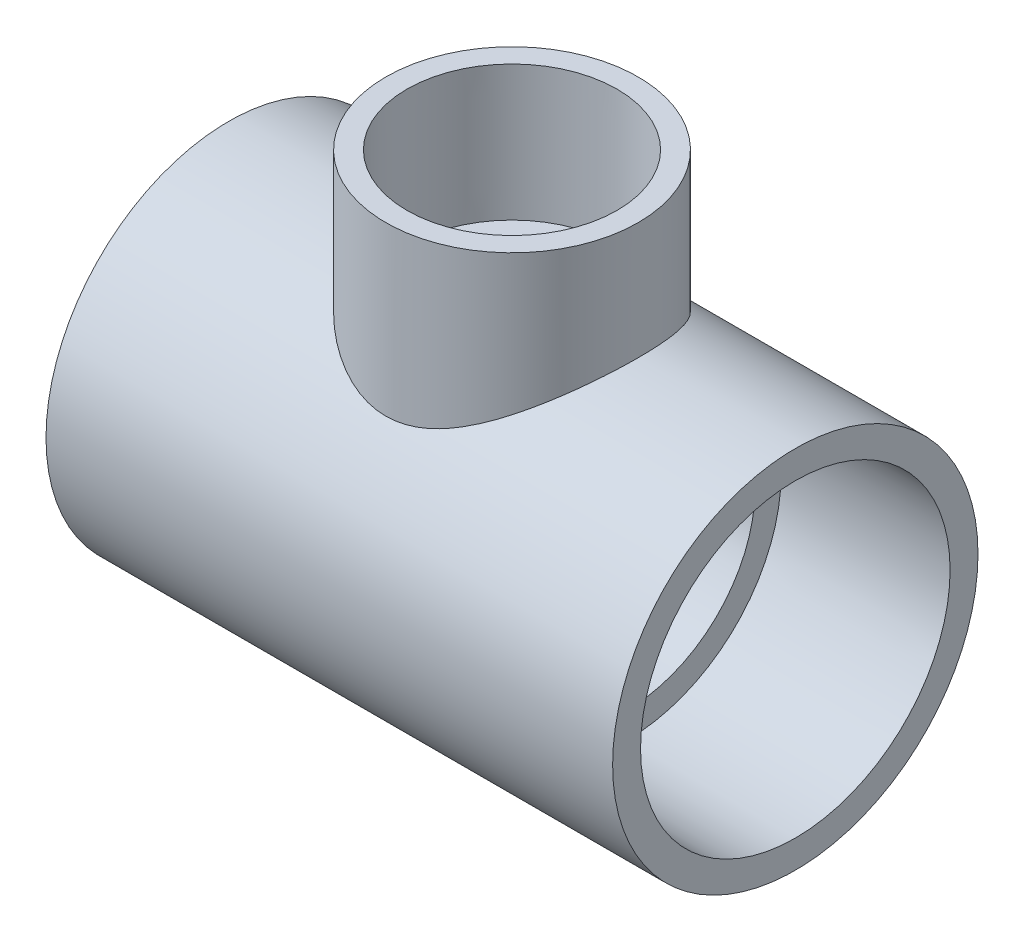
ISO-10303-21;
HEADER;
FILE_DESCRIPTION(('STEP AP214'),'2;1');
FILE_NAME('part.step','',(''),(''),'','','');
FILE_SCHEMA(('AUTOMOTIVE_DESIGN { 1 0 10303 214 1 1 1 1 }'));
ENDSEC;
DATA;
#1=APPLICATION_CONTEXT('core data for automotive mechanical design processes');
#2=APPLICATION_PROTOCOL_DEFINITION('international standard','automotive_design',2000,#1);
#3=PRODUCT_CONTEXT('',#1,'mechanical');
#4=PRODUCT('Part','Part','',(#3));
#5=PRODUCT_RELATED_PRODUCT_CATEGORY('part','',(#4));
#6=PRODUCT_DEFINITION_FORMATION('','',#4);
#7=PRODUCT_DEFINITION_CONTEXT('part definition',#1,'design');
#8=PRODUCT_DEFINITION('design','',#6,#7);
#9=PRODUCT_DEFINITION_SHAPE('','',#8);
#10=(LENGTH_UNIT() NAMED_UNIT(*) SI_UNIT(.MILLI.,.METRE.));
#11=(NAMED_UNIT(*) PLANE_ANGLE_UNIT() SI_UNIT($,.RADIAN.));
#12=(NAMED_UNIT(*) SI_UNIT($,.STERADIAN.) SOLID_ANGLE_UNIT());
#13=UNCERTAINTY_MEASURE_WITH_UNIT(LENGTH_MEASURE(1.E-05),#10,'distance_accuracy_value','');
#14=(GEOMETRIC_REPRESENTATION_CONTEXT(3) GLOBAL_UNCERTAINTY_ASSIGNED_CONTEXT((#13)) GLOBAL_UNIT_ASSIGNED_CONTEXT((#10,
#11,#12)) REPRESENTATION_CONTEXT('',''));
#15=CARTESIAN_POINT('',(0.,0.,0.));
#16=DIRECTION('',(0.,0.,1.));
#17=DIRECTION('',(1.,0.,0.));
#18=AXIS2_PLACEMENT_3D('',#15,#16,#17);
#19=CARTESIAN_POINT('',(-33.2994,0.,0.));
#20=DIRECTION('',(1.,0.,0.));
#21=DIRECTION('',(0.,0.,-1.));
#22=AXIS2_PLACEMENT_3D('',#19,#20,#21);
#23=PLANE('',#22);
#24=CARTESIAN_POINT('',(-33.2994,0.,0.));
#25=DIRECTION('',(-1.,0.,0.));
#26=DIRECTION('',(0.,0.,1.));
#27=AXIS2_PLACEMENT_3D('',#24,#25,#26);
#28=CIRCLE('',#27,44.3484);
#29=CARTESIAN_POINT('',(-33.2994,0.,44.3484));
#30=VERTEX_POINT('',#29);
#31=EDGE_CURVE('E97',#30,#30,#28,.T.);
#32=ORIENTED_EDGE('',*,*,#31,.T.);
#33=EDGE_LOOP('',(#32));
#34=FACE_BOUND('',#33,.T.);
#35=CARTESIAN_POINT('',(-33.2994,0.,0.));
#36=DIRECTION('',(1.,0.,0.));
#37=DIRECTION('',(0.,0.,-1.));
#38=AXIS2_PLACEMENT_3D('',#35,#36,#37);
#39=CIRCLE('',#38,36.83);
#40=CARTESIAN_POINT('',(-33.2994,0.,-36.83));
#41=VERTEX_POINT('',#40);
#42=EDGE_CURVE('E100',#41,#41,#39,.T.);
#43=ORIENTED_EDGE('',*,*,#42,.T.);
#44=EDGE_LOOP('',(#43));
#45=FACE_BOUND('',#44,.T.);
#46=ADVANCED_FACE('F30',(#34,#45),#23,.F.);
#47=CARTESIAN_POINT('',(33.2994,0.,0.));
#48=DIRECTION('',(1.,0.,0.));
#49=DIRECTION('',(0.,0.,-1.));
#50=AXIS2_PLACEMENT_3D('',#47,#48,#49);
#51=PLANE('',#50);
#52=CARTESIAN_POINT('',(33.2994,0.,0.));
#53=DIRECTION('',(1.,0.,0.));
#54=DIRECTION('',(0.,0.,-1.));
#55=AXIS2_PLACEMENT_3D('',#52,#53,#54);
#56=CIRCLE('',#55,36.83);
#57=CARTESIAN_POINT('',(33.2994,0.,-36.83));
#58=VERTEX_POINT('',#57);
#59=EDGE_CURVE('E103',#58,#58,#56,.T.);
#60=ORIENTED_EDGE('',*,*,#59,.F.);
#61=EDGE_LOOP('',(#60));
#62=FACE_BOUND('',#61,.T.);
#63=CARTESIAN_POINT('',(33.2994,0.,0.));
#64=DIRECTION('',(1.,0.,0.));
#65=DIRECTION('',(0.,0.,-1.));
#66=AXIS2_PLACEMENT_3D('',#63,#64,#65);
#67=CIRCLE('',#66,44.3484);
#68=CARTESIAN_POINT('',(33.2994,0.,-44.3484));
#69=VERTEX_POINT('',#68);
#70=EDGE_CURVE('E10',#69,#69,#67,.F.);
#71=ORIENTED_EDGE('',*,*,#70,.F.);
#72=EDGE_LOOP('',(#71));
#73=FACE_BOUND('',#72,.T.);
#74=ADVANCED_FACE('F72',(#62,#73),#51,.T.);
#75=CARTESIAN_POINT('',(33.2994,0.,0.));
#76=DIRECTION('',(-1.,0.,0.));
#77=DIRECTION('',(0.,0.,1.));
#78=AXIS2_PLACEMENT_3D('',#75,#76,#77);
#79=CYLINDRICAL_SURFACE('',#78,52.705);
#80=CARTESIAN_POINT('',(-81.7372,0.,0.));
#81=DIRECTION('',(-1.,0.,0.));
#82=DIRECTION('',(0.,0.,1.));
#83=AXIS2_PLACEMENT_3D('',#80,#81,#82);
#84=CIRCLE('',#83,52.705);
#85=CARTESIAN_POINT('',(-81.7372,0.,52.705));
#86=VERTEX_POINT('',#85);
#87=EDGE_CURVE('E114',#86,#86,#84,.T.);
#88=ORIENTED_EDGE('',*,*,#87,.F.);
#89=EDGE_LOOP('',(#88));
#90=FACE_BOUND('',#89,.T.);
#91=CARTESIAN_POINT('',(81.7372,0.,0.));
#92=DIRECTION('',(-1.,0.,0.));
#93=DIRECTION('',(0.,0.,1.));
#94=AXIS2_PLACEMENT_3D('',#91,#92,#93);
#95=CIRCLE('',#94,52.705);
#96=CARTESIAN_POINT('',(81.7372,0.,52.705));
#97=VERTEX_POINT('',#96);
#98=EDGE_CURVE('E102',#97,#97,#95,.T.);
#99=ORIENTED_EDGE('',*,*,#98,.T.);
#100=EDGE_LOOP('',(#99));
#101=FACE_BOUND('',#100,.T.);
#102=CARTESIAN_POINT('',(33.2994,50.6054683463161,-14.7276474173576));
#103=CARTESIAN_POINT('',(32.8665611440652,50.3206502251527,-15.7062959214014));
#104=CARTESIAN_POINT('',(32.3930904135624,50.0122199897805,-16.6601238236715));
#105=CARTESIAN_POINT('',(31.3710163571658,49.3563608444083,-18.5130654533819));
#106=CARTESIAN_POINT('',(30.822367998837,49.0089085823483,-19.4121459165471));
#107=CARTESIAN_POINT('',(29.6542641212973,48.2828000839408,-21.1537453269061));
#108=CARTESIAN_POINT('',(29.0346080672534,47.9040563609287,-21.9960928596377));
#109=CARTESIAN_POINT('',(27.7309250428089,47.125303807805,-23.6184750539674));
#110=CARTESIAN_POINT('',(27.0469080016118,46.7252982619615,-24.3985192931031));
#111=CARTESIAN_POINT('',(25.6224134085627,45.9154646524918,-25.8902186948125));
#112=CARTESIAN_POINT('',(24.8822656767589,45.5057024008569,-26.6022250876623));
#113=CARTESIAN_POINT('',(23.3452436936839,44.6837992323151,-27.9607833996699));
#114=CARTESIAN_POINT('',(22.548364001516,44.2716580907526,-28.6073290263504));
#115=CARTESIAN_POINT('',(20.9009364720651,43.4557336191509,-29.832151157849));
#116=CARTESIAN_POINT('',(20.0504348440655,43.0519434805709,-30.4104852433529));
#117=CARTESIAN_POINT('',(18.2970327764897,42.2638335931482,-31.4965925625555));
#118=CARTESIAN_POINT('',(17.3941434405788,41.8795097504999,-32.0043806717088));
#119=CARTESIAN_POINT('',(15.7160838272372,41.2138942464681,-32.8552165917502));
#120=CARTESIAN_POINT('',(14.9496732904478,40.9269876499965,-33.21117575846));
#121=CARTESIAN_POINT('',(13.3851747955389,40.3817890030868,-33.871988591524));
#122=CARTESIAN_POINT('',(12.5870886395015,40.1234953279695,-34.1768451600559));
#123=CARTESIAN_POINT('',(10.9626943903986,39.6439530669855,-34.731951641189));
#124=CARTESIAN_POINT('',(10.1364318311576,39.4226478324421,-34.9822852386291));
#125=CARTESIAN_POINT('',(8.45805652514074,39.0248412404425,-35.425523690364));
#126=CARTESIAN_POINT('',(7.60594842254273,38.8483318863998,-35.6184387955925));
#127=CARTESIAN_POINT('',(6.00983093750421,38.5701865441199,-35.9192590160114));
#128=CARTESIAN_POINT('',(5.26866149354494,38.4613086919072,-36.0355531696703));
#129=CARTESIAN_POINT('',(3.77565851961246,38.285373772421,-36.22242099782));
#130=CARTESIAN_POINT('',(3.02382616915657,38.2183121158308,-36.2929996896039));
#131=CARTESIAN_POINT('',(1.51501165500658,38.1286236004495,-36.3872143075746));
#132=CARTESIAN_POINT('',(0.758032839840528,38.1059701930336,-36.4108782809269));
#133=CARTESIAN_POINT('',(-0.755948742673274,38.1059288087277,-36.410921689249));
#134=CARTESIAN_POINT('',(-1.51295151013983,38.1285419853253,-36.387299919279));
#135=CARTESIAN_POINT('',(-3.02016063396608,38.2180535473463,-36.2932714239998));
#136=CARTESIAN_POINT('',(-3.77037587925651,38.2848814983369,-36.2229391082268));
#137=CARTESIAN_POINT('',(-5.2601415011837,38.4601756002979,-36.0367613553237));
#138=CARTESIAN_POINT('',(-5.99969194991259,38.5686414696664,-35.9209162260017));
#139=CARTESIAN_POINT('',(-7.46473392516924,38.8235048233906,-35.6453034027117));
#140=CARTESIAN_POINT('',(-8.19020868103966,38.9699448875812,-35.4854863914474));
#141=CARTESIAN_POINT('',(-9.6230195466557,39.2960416236094,-35.1240275242703));
#142=CARTESIAN_POINT('',(-10.3303531533905,39.4757028513339,-34.9223799313285));
#143=CARTESIAN_POINT('',(-11.9799198902796,39.9342568934599,-34.3981650588975));
#144=CARTESIAN_POINT('',(-12.9133066207616,40.2253939983238,-34.0583595063446));
#145=CARTESIAN_POINT('',(-14.7380138905766,40.8477154162274,-33.3094297534369));
#146=CARTESIAN_POINT('',(-15.6293191463432,41.178914126027,-32.9002806120711));
#147=CARTESIAN_POINT('',(-17.3689838676186,41.8701168408864,-32.0160236286731));
#148=CARTESIAN_POINT('',(-18.2172648917961,42.2301705748192,-31.5408008325445));
#149=CARTESIAN_POINT('',(-19.8675565923446,42.9678761888124,-30.5282005108595));
#150=CARTESIAN_POINT('',(-20.6695720826729,43.3455262305475,-29.9908294694133));
#151=CARTESIAN_POINT('',(-22.2434900465209,44.1175186246307,-28.8435492699077));
#152=CARTESIAN_POINT('',(-23.0143112341843,44.5120453785776,-28.2322817130732));
#153=CARTESIAN_POINT('',(-24.5043332102096,45.3003987182131,-26.9491733728839));
#154=CARTESIAN_POINT('',(-25.2235284457894,45.694225224155,-26.2773260911787));
#155=CARTESIAN_POINT('',(-26.6061644865444,46.4717696567967,-24.8763393680838));
#156=CARTESIAN_POINT('',(-27.2697192241618,46.8555070779107,-24.147323225635));
#157=CARTESIAN_POINT('',(-28.5393006590755,47.6055973250572,-22.6326709518308));
#158=CARTESIAN_POINT('',(-29.1453458220272,47.971955712271,-21.8470531381234));
#159=CARTESIAN_POINT('',(-30.0659510172286,48.5381376917172,-20.5462838819497));
#160=CARTESIAN_POINT('',(-30.4002348214987,48.7460213205137,-20.0484651418164));
#161=CARTESIAN_POINT('',(-31.0455920646813,49.1510837771071,-19.0338187414247));
#162=CARTESIAN_POINT('',(-31.3566680671288,49.3482637865689,-18.5169931901031));
#163=CARTESIAN_POINT('',(-31.9546738951111,49.7303896450844,-17.4647873989957));
#164=CARTESIAN_POINT('',(-32.2415920043957,49.9153295486564,-16.9293983318419));
#165=CARTESIAN_POINT('',(-32.7899107007319,50.2712458436698,-15.8412930118723));
#166=CARTESIAN_POINT('',(-33.0513142880007,50.4422238764809,-15.2885788064177));
#167=CARTESIAN_POINT('',(-33.6424061957271,50.8311720521861,-13.952097143725));
#168=CARTESIAN_POINT('',(-33.95995374164,51.0420921632532,-13.1608387788513));
#169=CARTESIAN_POINT('',(-34.5408619208921,51.4304177659738,-11.5505514861348));
#170=CARTESIAN_POINT('',(-34.8042158784084,51.6078191284093,-10.7315191514201));
#171=CARTESIAN_POINT('',(-35.2737264903061,51.9256129183516,-9.06990879162915));
#172=CARTESIAN_POINT('',(-35.4798694863415,52.0659965079659,-8.22732519676341));
#173=CARTESIAN_POINT('',(-35.832195181296,52.3067207696972,-6.52408111197113));
#174=CARTESIAN_POINT('',(-35.9783804414547,52.4070631522661,-5.66342139586118));
#175=CARTESIAN_POINT('',(-36.2091175780468,52.5657353000021,-3.92718298064145));
#176=CARTESIAN_POINT('',(-36.2934708025879,52.6239296462847,-3.05156536475282));
#177=CARTESIAN_POINT('',(-36.3985141631615,52.6964303180674,-1.29468324512423));
#178=CARTESIAN_POINT('',(-36.4192035409758,52.7107361208676,-0.413418674255921));
#179=CARTESIAN_POINT('',(-36.3966022283054,52.6951228936678,1.34775556525929));
#180=CARTESIAN_POINT('',(-36.3533213658443,52.6652106570756,2.22766542124741));
#181=CARTESIAN_POINT('',(-36.2034568064999,52.5618752263174,3.97946728956689));
#182=CARTESIAN_POINT('',(-36.0968743828008,52.4884529072695,4.85135946279972));
#183=CARTESIAN_POINT('',(-35.8273704700079,52.3034863033774,6.54682993662916));
#184=CARTESIAN_POINT('',(-35.6668185241748,52.1935473737847,7.37096319994951));
#185=CARTESIAN_POINT('',(-35.29078158674,51.9373056826485,9.00076675563747));
#186=CARTESIAN_POINT('',(-35.0752982644282,51.7910040261224,9.80643760824198));
#187=CARTESIAN_POINT('',(-34.5918634344535,51.4648285644133,11.3950042351841));
#188=CARTESIAN_POINT('',(-34.3239033591973,51.2849492774185,12.1778962665431));
#189=CARTESIAN_POINT('',(-33.7383125571079,50.8948862098211,13.717070808442));
#190=CARTESIAN_POINT('',(-33.4206792941219,50.6847008819325,14.4733519578997));
#191=CARTESIAN_POINT('',(-32.7134685912182,50.2210903070328,16.0109498755409));
#192=CARTESIAN_POINT('',(-32.3203139383632,49.9656198358427,16.7900031527964));
#193=CARTESIAN_POINT('',(-31.4835429520878,49.4284730412317,18.3110281875485));
#194=CARTESIAN_POINT('',(-31.0399246069283,49.1467956731523,19.05299846503));
#195=CARTESIAN_POINT('',(-30.1052347741445,48.5618736477131,20.4980323651676));
#196=CARTESIAN_POINT('',(-29.6141391418831,48.2586180376238,21.20107590272));
#197=CARTESIAN_POINT('',(-28.5875763235232,47.6355591989406,22.5662049373814));
#198=CARTESIAN_POINT('',(-28.0521067538933,47.3157550817961,23.2282882309842));
#199=CARTESIAN_POINT('',(-26.8451055332056,46.6094894703358,24.6186685140071));
#200=CARTESIAN_POINT('',(-26.1658799833141,46.2209032995252,25.3392211726244));
#201=CARTESIAN_POINT('',(-24.7533191797111,45.4361661940416,26.7208375279026));
#202=CARTESIAN_POINT('',(-24.0199759815214,45.0400141550503,27.3818924585465));
#203=CARTESIAN_POINT('',(-22.5011790462176,44.2486828315093,28.6430724286313));
#204=CARTESIAN_POINT('',(-21.7156907214494,43.85350437662,29.2431563449235));
#205=CARTESIAN_POINT('',(-20.0949583242449,43.0739591687632,30.379693147953));
#206=CARTESIAN_POINT('',(-19.259720655873,42.6895910335574,30.9161541981678));
#207=CARTESIAN_POINT('',(-17.6363811139841,41.9837132239077,31.8668407042577));
#208=CARTESIAN_POINT('',(-16.8533288969269,41.6599605607831,32.2880243622812));
#209=CARTESIAN_POINT('',(-15.2502524567415,41.037642068012,33.0753799210958));
#210=CARTESIAN_POINT('',(-14.4302279178686,40.7390764535261,33.4415513519655));
#211=CARTESIAN_POINT('',(-12.7563998331406,40.1767209604795,34.1151050854999));
#212=CARTESIAN_POINT('',(-11.9026525748974,39.9128760732178,34.4225807379996));
#213=CARTESIAN_POINT('',(-10.1632124086143,39.4291426928053,34.9756336342444));
#214=CARTESIAN_POINT('',(-9.2775273334437,39.2092435071994,35.2212259386671));
#215=CARTESIAN_POINT('',(-7.64770239071675,38.8592513906805,35.6066012870361));
#216=CARTESIAN_POINT('',(-6.90815967021484,38.7200506367341,35.7575894274376));
#217=CARTESIAN_POINT('',(-5.4148302752731,38.4816956253047,36.0139820623098));
#218=CARTESIAN_POINT('',(-4.66104537736711,38.3825364072131,36.1193922033972));
#219=CARTESIAN_POINT('',(-3.1446007043365,38.2280480749643,36.2828622168616));
#220=CARTESIAN_POINT('',(-2.38195024079909,38.1726765654167,36.3409678911762));
#221=CARTESIAN_POINT('',(-0.852517068051437,38.1078276534348,36.4089652803883));
#222=CARTESIAN_POINT('',(-0.0857343015880634,38.0983508885181,36.4188563255432));
#223=CARTESIAN_POINT('',(1.44647036672971,38.1256948399528,36.3902293215398));
#224=CARTESIAN_POINT('',(2.21189139954134,38.1625386402308,36.3516871356091));
#225=CARTESIAN_POINT('',(3.7352741108432,38.2810505131101,36.2268618829026));
#226=CARTESIAN_POINT('',(4.49323583527374,38.3627183094739,36.1405791103385));
#227=CARTESIAN_POINT('',(5.99759552435104,38.5678418477658,35.9215955283517));
#228=CARTESIAN_POINT('',(6.74397811376741,38.6913488810612,35.7888377377823));
#229=CARTESIAN_POINT('',(8.22017866661303,38.9757582674928,35.4788868446909));
#230=CARTESIAN_POINT('',(8.94999440598541,39.1366656093148,35.3016878140707));
#231=CARTESIAN_POINT('',(10.6026044846279,39.5431621217943,34.846433733906));
#232=CARTESIAN_POINT('',(11.518770113632,39.7997275161389,34.5540476123375));
#233=CARTESIAN_POINT('',(13.313740491016,40.3557908661739,33.902953291411));
#234=CARTESIAN_POINT('',(14.1925335952564,40.6553020772324,33.5442246052583));
#235=CARTESIAN_POINT('',(15.9109879774542,41.2866014567791,32.7640896954131));
#236=CARTESIAN_POINT('',(16.7506026206021,41.6184267090696,32.3426111592765));
#237=CARTESIAN_POINT('',(18.387915959168,42.3039721654088,31.4406081641494));
#238=CARTESIAN_POINT('',(19.1856172478921,42.6576910118782,30.9600873644388));
#239=CARTESIAN_POINT('',(20.7551427780747,43.3860049998939,29.9312147062024));
#240=CARTESIAN_POINT('',(21.5260001407215,43.7608892066854,29.381594372507));
#241=CARTESIAN_POINT('',(23.0211999075391,44.5154189224703,28.2253628731629));
#242=CARTESIAN_POINT('',(23.7455423472477,44.8950644278256,27.6187517510565));
#243=CARTESIAN_POINT('',(25.1460904837655,45.6513065963607,26.349968767592));
#244=CARTESIAN_POINT('',(25.8222792827948,46.0279021485836,25.687777578278));
#245=CARTESIAN_POINT('',(27.1237995177498,46.7704857961448,24.3094952961893));
#246=CARTESIAN_POINT('',(27.749126383615,47.1364729363956,23.5933993710576));
#247=CARTESIAN_POINT('',(29.0423175559362,47.9083354710608,21.9891644640086));
#248=CARTESIAN_POINT('',(29.7007682478271,48.3111200768233,21.0919080786322));
#249=CARTESIAN_POINT('',(30.9388680861248,49.0819958991459,19.2299105842522));
#250=CARTESIAN_POINT('',(31.5185036014474,49.4500811110785,18.2651578453418));
#251=CARTESIAN_POINT('',(32.3227717839963,49.9678212887829,16.7723375089251));
#252=CARTESIAN_POINT('',(32.5798715062268,50.1345864760821,16.2674104046566));
#253=CARTESIAN_POINT('',(33.0716110882109,50.4555259188384,15.2428639265858));
#254=CARTESIAN_POINT('',(33.306254193056,50.60970199301,14.7232466896799));
#255=CARTESIAN_POINT('',(33.7520591282481,50.9041932641099,13.6703647360248));
#256=CARTESIAN_POINT('',(33.9632274701851,51.0445123035853,13.1371038545849));
#257=CARTESIAN_POINT('',(34.3611670163045,51.3101477110023,12.0579685462653));
#258=CARTESIAN_POINT('',(34.5479404330373,51.435465439434,11.5120952685865));
#259=CARTESIAN_POINT('',(34.9771522568925,51.724548070549,10.1523486276514));
#260=CARTESIAN_POINT('',(35.2051036302705,51.8791032326492,9.33185859986233));
#261=CARTESIAN_POINT('',(35.6038768900193,52.1505332517521,7.67116562842779));
#262=CARTESIAN_POINT('',(35.7747088312924,52.267414740432,6.83096618218611));
#263=CARTESIAN_POINT('',(36.0570155104442,52.4610444611188,5.13640335433802));
#264=CARTESIAN_POINT('',(36.1685153133743,52.5378096401426,4.28204611127758));
#265=CARTESIAN_POINT('',(36.3306906124574,52.6495869653268,2.56482874986071));
#266=CARTESIAN_POINT('',(36.3813648510638,52.6845982482404,1.70196845607859));
#267=CARTESIAN_POINT('',(36.4211780435257,52.7120990276286,-0.0273623829781833));
#268=CARTESIAN_POINT('',(36.4102095635025,52.7045142857299,-0.89383659974274));
#269=CARTESIAN_POINT('',(36.3266482169876,52.6468218450479,-2.6224221319165));
#270=CARTESIAN_POINT('',(36.2540516466636,52.5967115904923,-3.48453318196776));
#271=CARTESIAN_POINT('',(36.0483444674899,52.4551328892648,-5.19752139302493));
#272=CARTESIAN_POINT('',(35.9152698830672,52.3636890635865,-6.04840493178543));
#273=CARTESIAN_POINT('',(35.5905104505232,52.141479066308,-7.73339226910032));
#274=CARTESIAN_POINT('',(35.398840110652,52.0107226286035,-8.56750016686188));
#275=CARTESIAN_POINT('',(34.9332820875543,51.6949212592809,-10.3115164035959));
#276=CARTESIAN_POINT('',(34.6523501099111,51.5052836750323,-11.2187174070705));
#277=CARTESIAN_POINT('',(34.024388173766,51.0849104284347,-12.9994611769086));
#278=CARTESIAN_POINT('',(33.677387195239,50.8541927879776,-13.8730184992363));
#279=CARTESIAN_POINT('',(33.2994,50.6054683463161,-14.7276474173576));
#280=B_SPLINE_CURVE_WITH_KNOTS('',3,(#102,#103,#104,#105,#106,#107,#108,#109,#110,#111,#112,
#113,#114,#115,#116,#117,#118,#119,#120,#121,#122,#123,#124,#125,#126,#127,#128,#129,#130,#131,
#132,#133,#134,#135,#136,#137,#138,#139,#140,#141,#142,#143,#144,#145,#146,#147,#148,#149,#150,
#151,#152,#153,#154,#155,#156,#157,#158,#159,#160,#161,#162,#163,#164,#165,#166,#167,#168,#169,
#170,#171,#172,#173,#174,#175,#176,#177,#178,#179,#180,#181,#182,#183,#184,#185,#186,#187,#188,
#189,#190,#191,#192,#193,#194,#195,#196,#197,#198,#199,#200,#201,#202,#203,#204,#205,#206,#207,
#208,#209,#210,#211,#212,#213,#214,#215,#216,#217,#218,#219,#220,#221,#222,#223,#224,#225,#226,
#227,#228,#229,#230,#231,#232,#233,#234,#235,#236,#237,#238,#239,#240,#241,#242,#243,#244,#245,
#246,#247,#248,#249,#250,#251,#252,#253,#254,#255,#256,#257,#258,#259,#260,#261,#262,#263,#264,
#265,#266,#267,#268,#269,#270,#271,#272,#273,#274,#275,#276,#277,#278,#279),.UNSPECIFIED.,.T.,
.F.,(4,2,2,2,2,2,2,2,2,2,2,2,2,2,2,2,2,2,2,2,2,2,2,2,2,2,2,2,2,2,2,2,2,2,2,2,2,2,2,2,2,2,2,2,2,
2,2,2,2,2,2,2,2,2,2,2,2,2,2,2,2,2,2,2,2,2,2,2,2,2,2,2,2,2,2,2,2,2,2,2,2,2,2,2,2,2,2,2,4),(0.,
3.32096507607777,6.64392822402962,9.9765185406003,13.3085955666868,16.622419315588,
19.9365613070575,23.2478853373451,26.5585100725334,29.2335298213485,31.9083976010861,
34.5791304543606,37.2493862148288,39.5212435459262,41.7928514973615,44.0631009966516,
46.3334083473956,48.6001077631511,50.8667918492338,53.1360286039808,55.4055767886368,
58.5063252251836,61.6081912929954,64.7155230953757,67.8225309926169,70.9993396439629,
74.176489475972,77.3469661010442,80.5164212537291,82.4196860093334,84.322740217974,
86.2267121286457,88.1304598835061,90.7626037089452,93.3950715804816,96.0281673786763,
98.6611506860978,101.302556515603,103.943993803368,106.585025317922,109.22600371522,
111.763567085078,114.301053351016,116.838954244395,119.376984757134,122.102089588433,
124.827303094349,127.553909875494,130.280663210465,133.468664742063,136.657135207278,
139.84774212174,143.03793920411,145.874237510441,148.71056004342,151.542333402311,
154.373416919613,156.673679592521,158.973657206271,161.271405239045,163.569185189425,
165.868110696104,168.167022035316,170.468761906099,172.770808973626,175.752397409466,
178.734908111359,181.720882827682,184.706672574617,187.758711252709,190.810747598989,
193.863849722803,196.917225872452,200.463214065692,204.009814759621,205.781136659013,
207.552202205997,209.322775250379,211.093187597138,213.686634242263,216.279624114669,
218.871517698816,221.463464868505,224.059930807046,226.656552803573,229.251630115392,
231.846065408371,234.74744970326,237.647564277961),.UNSPECIFIED.);
#281=CARTESIAN_POINT('',(33.2994,50.6054683463161,-14.7276474173576));
#282=VERTEX_POINT('',#281);
#283=EDGE_CURVE('E55',#282,#282,#280,.T.);
#284=ORIENTED_EDGE('',*,*,#283,.F.);
#285=EDGE_LOOP('',(#284));
#286=FACE_BOUND('',#285,.T.);
#287=ADVANCED_FACE('F67',(#90,#101,#286),#79,.T.);
#288=CARTESIAN_POINT('',(-33.2994,0.,0.));
#289=DIRECTION('',(-1.,0.,0.));
#290=DIRECTION('',(0.,0.,1.));
#291=AXIS2_PLACEMENT_3D('',#288,#289,#290);
#292=CONICAL_SURFACE('',#291,44.3484,0.00629252313381877);
#293=CARTESIAN_POINT('',(-81.7372,0.,0.));
#294=DIRECTION('',(-1.,0.,0.));
#295=DIRECTION('',(0.,0.,1.));
#296=AXIS2_PLACEMENT_3D('',#293,#294,#295);
#297=CIRCLE('',#296,44.6532);
#298=CARTESIAN_POINT('',(-81.7372,0.,44.6532));
#299=VERTEX_POINT('',#298);
#300=EDGE_CURVE('E62',#299,#299,#297,.T.);
#301=ORIENTED_EDGE('',*,*,#300,.T.);
#302=EDGE_LOOP('',(#301));
#303=FACE_BOUND('',#302,.T.);
#304=ORIENTED_EDGE('',*,*,#31,.F.);
#305=EDGE_LOOP('',(#304));
#306=FACE_BOUND('',#305,.T.);
#307=ADVANCED_FACE('F71',(#303,#306),#292,.F.);
#308=CARTESIAN_POINT('',(81.7372,0.,0.));
#309=DIRECTION('',(1.,0.,0.));
#310=DIRECTION('',(0.,0.,-1.));
#311=AXIS2_PLACEMENT_3D('',#308,#309,#310);
#312=CONICAL_SURFACE('',#311,44.6532,0.00629252313381848);
#313=CARTESIAN_POINT('',(81.7372,0.,0.));
#314=DIRECTION('',(-1.,0.,0.));
#315=DIRECTION('',(0.,0.,1.));
#316=AXIS2_PLACEMENT_3D('',#313,#314,#315);
#317=CIRCLE('',#316,44.6532);
#318=CARTESIAN_POINT('',(81.7372,0.,44.6532));
#319=VERTEX_POINT('',#318);
#320=EDGE_CURVE('E106',#319,#319,#317,.T.);
#321=ORIENTED_EDGE('',*,*,#320,.F.);
#322=EDGE_LOOP('',(#321));
#323=FACE_BOUND('',#322,.T.);
#324=ORIENTED_EDGE('',*,*,#70,.T.);
#325=EDGE_LOOP('',(#324));
#326=FACE_BOUND('',#325,.T.);
#327=ADVANCED_FACE('F84',(#323,#326),#312,.F.);
#328=CARTESIAN_POINT('',(0.,0.,0.));
#329=DIRECTION('',(0.,-1.,0.));
#330=DIRECTION('',(1.,0.,0.));
#331=AXIS2_PLACEMENT_3D('',#328,#329,#330);
#332=CYLINDRICAL_SURFACE('',#331,36.4109);
#333=ORIENTED_EDGE('',*,*,#283,.T.);
#334=EDGE_LOOP('',(#333));
#335=FACE_BOUND('',#334,.T.);
#336=CARTESIAN_POINT('',(0.,86.4616,0.));
#337=DIRECTION('',(0.,-1.,0.));
#338=DIRECTION('',(1.,0.,0.));
#339=AXIS2_PLACEMENT_3D('',#336,#337,#338);
#340=CIRCLE('',#339,36.4109);
#341=CARTESIAN_POINT('',(36.4109,86.4616,0.));
#342=VERTEX_POINT('',#341);
#343=EDGE_CURVE('E43',#342,#342,#340,.T.);
#344=ORIENTED_EDGE('',*,*,#343,.T.);
#345=EDGE_LOOP('',(#344));
#346=FACE_BOUND('',#345,.T.);
#347=ADVANCED_FACE('F64',(#335,#346),#332,.T.);
#348=CARTESIAN_POINT('',(0.,86.4616,0.));
#349=DIRECTION('',(0.,1.,0.));
#350=DIRECTION('',(-1.,0.,0.));
#351=AXIS2_PLACEMENT_3D('',#348,#349,#350);
#352=CONICAL_SURFACE('',#351,30.3149,0.00588613215180149);
#353=CARTESIAN_POINT('',(0.,86.4616,0.));
#354=DIRECTION('',(0.,-1.,0.));
#355=DIRECTION('',(1.,0.,0.));
#356=AXIS2_PLACEMENT_3D('',#353,#354,#355);
#357=CIRCLE('',#356,30.3149);
#358=CARTESIAN_POINT('',(30.3149,86.4616,0.));
#359=VERTEX_POINT('',#358);
#360=EDGE_CURVE('E52',#359,#359,#357,.T.);
#361=ORIENTED_EDGE('',*,*,#360,.F.);
#362=EDGE_LOOP('',(#361));
#363=FACE_BOUND('',#362,.T.);
#364=CARTESIAN_POINT('',(0.,47.625,0.));
#365=DIRECTION('',(0.,-1.,0.));
#366=DIRECTION('',(1.,0.,0.));
#367=AXIS2_PLACEMENT_3D('',#364,#365,#366);
#368=CIRCLE('',#367,30.0863);
#369=CARTESIAN_POINT('',(30.0863,47.625,0.));
#370=VERTEX_POINT('',#369);
#371=EDGE_CURVE('E47',#370,#370,#368,.T.);
#372=ORIENTED_EDGE('',*,*,#371,.T.);
#373=EDGE_LOOP('',(#372));
#374=FACE_BOUND('',#373,.T.);
#375=ADVANCED_FACE('F75',(#363,#374),#352,.F.);
#376=CARTESIAN_POINT('',(36.4109,86.4616,0.));
#377=DIRECTION('',(0.,1.,0.));
#378=DIRECTION('',(-1.,0.,0.));
#379=AXIS2_PLACEMENT_3D('',#376,#377,#378);
#380=PLANE('',#379);
#381=ORIENTED_EDGE('',*,*,#360,.T.);
#382=EDGE_LOOP('',(#381));
#383=FACE_BOUND('',#382,.T.);
#384=ORIENTED_EDGE('',*,*,#343,.F.);
#385=EDGE_LOOP('',(#384));
#386=FACE_BOUND('',#385,.T.);
#387=ADVANCED_FACE('F32',(#383,#386),#380,.T.);
#388=CARTESIAN_POINT('',(-81.7372,-52.705,0.));
#389=DIRECTION('',(-1.,0.,0.));
#390=DIRECTION('',(0.,0.,1.));
#391=AXIS2_PLACEMENT_3D('',#388,#389,#390);
#392=PLANE('',#391);
#393=ORIENTED_EDGE('',*,*,#87,.T.);
#394=EDGE_LOOP('',(#393));
#395=FACE_BOUND('',#394,.T.);
#396=ORIENTED_EDGE('',*,*,#300,.F.);
#397=EDGE_LOOP('',(#396));
#398=FACE_BOUND('',#397,.T.);
#399=ADVANCED_FACE('F82',(#395,#398),#392,.T.);
#400=CARTESIAN_POINT('',(81.7372,-52.705,0.));
#401=DIRECTION('',(1.,0.,0.));
#402=DIRECTION('',(0.,0.,-1.));
#403=AXIS2_PLACEMENT_3D('',#400,#401,#402);
#404=PLANE('',#403);
#405=ORIENTED_EDGE('',*,*,#320,.T.);
#406=EDGE_LOOP('',(#405));
#407=FACE_BOUND('',#406,.T.);
#408=ORIENTED_EDGE('',*,*,#98,.F.);
#409=EDGE_LOOP('',(#408));
#410=FACE_BOUND('',#409,.T.);
#411=ADVANCED_FACE('F122',(#407,#410),#404,.T.);
#412=CARTESIAN_POINT('',(0.,47.625,0.));
#413=DIRECTION('',(0.,-1.,0.));
#414=DIRECTION('',(1.,0.,0.));
#415=AXIS2_PLACEMENT_3D('',#412,#413,#414);
#416=PLANE('',#415);
#417=CARTESIAN_POINT('',(0.,47.625,0.));
#418=DIRECTION('',(0.,-1.,0.));
#419=DIRECTION('',(1.,0.,0.));
#420=AXIS2_PLACEMENT_3D('',#417,#418,#419);
#421=CIRCLE('',#420,24.6253);
#422=CARTESIAN_POINT('',(24.6253,47.625,0.));
#423=VERTEX_POINT('',#422);
#424=EDGE_CURVE('E154',#423,#423,#421,.T.);
#425=ORIENTED_EDGE('',*,*,#424,.T.);
#426=EDGE_LOOP('',(#425));
#427=FACE_BOUND('',#426,.T.);
#428=ORIENTED_EDGE('',*,*,#371,.F.);
#429=EDGE_LOOP('',(#428));
#430=FACE_BOUND('',#429,.T.);
#431=ADVANCED_FACE('F128',(#427,#430),#416,.F.);
#432=CARTESIAN_POINT('',(81.7372,0.,0.));
#433=DIRECTION('',(1.,0.,0.));
#434=DIRECTION('',(0.,0.,-1.));
#435=AXIS2_PLACEMENT_3D('',#432,#433,#434);
#436=CYLINDRICAL_SURFACE('',#435,36.83);
#437=CARTESIAN_POINT('',(24.6253,36.83,0.));
#438=CARTESIAN_POINT('',(24.6253004028023,36.8300003581273,0.618273832355962));
#439=CARTESIAN_POINT('',(24.6019845843674,36.8143986281794,1.23654321507656));
#440=CARTESIAN_POINT('',(24.5090917470984,36.7523861192532,2.46801909710877));
#441=CARTESIAN_POINT('',(24.4395152138491,36.7059756636648,3.081225649495));
#442=CARTESIAN_POINT('',(24.255133646099,36.5834698741434,4.29798656048581));
#443=CARTESIAN_POINT('',(24.1403124738274,36.507363948582,4.9015373950905));
#444=CARTESIAN_POINT('',(23.8670897317075,36.3272752429783,6.09441339771962));
#445=CARTESIAN_POINT('',(23.7086874684476,36.2232920193853,6.68373833923585));
#446=CARTESIAN_POINT('',(23.351231043346,35.9903488627625,7.84160771404175));
#447=CARTESIAN_POINT('',(23.1523746544581,35.8615105942544,8.41023795469776));
#448=CARTESIAN_POINT('',(22.7158303066996,35.5812372952182,9.52657820651526));
#449=CARTESIAN_POINT('',(22.4781425820872,35.4298024010095,10.074288343857));
#450=CARTESIAN_POINT('',(21.9662842696545,35.1072876850996,11.1463271564271));
#451=CARTESIAN_POINT('',(21.6921134889773,34.9362077595515,11.670655708036));
#452=CARTESIAN_POINT('',(21.1095709282746,34.577518860405,12.6940197753694));
#453=CARTESIAN_POINT('',(20.8011974792963,34.3899090803081,13.1930540551026));
#454=CARTESIAN_POINT('',(20.1247741343034,33.9848571538103,14.2056487619673));
#455=CARTESIAN_POINT('',(19.7538795233347,33.7662347983161,14.7168363004732));
#456=CARTESIAN_POINT('',(18.9767275877312,33.3175480916663,15.7062087998346));
#457=CARTESIAN_POINT('',(18.5704686546486,33.0874832202837,16.1843922578161));
#458=CARTESIAN_POINT('',(17.7240546174301,32.6199472490623,17.1071859795747));
#459=CARTESIAN_POINT('',(17.2838548490842,32.3824666436071,17.5517504255217));
#460=CARTESIAN_POINT('',(16.3716966385061,31.9049360537751,18.4055221967425));
#461=CARTESIAN_POINT('',(15.8997363207753,31.6648859183695,18.8147274307476));
#462=CARTESIAN_POINT('',(14.8479048959646,31.1490204835273,19.6588223266855));
#463=CARTESIAN_POINT('',(14.2628056321204,30.8735853347919,20.0874555757401));
#464=CARTESIAN_POINT('',(13.0533241466575,30.33380756688,20.8936456088189));
#465=CARTESIAN_POINT('',(12.4289329777819,30.0694674972022,21.271190697322));
#466=CARTESIAN_POINT('',(11.1435116796827,29.5613479100982,21.971860237937));
#467=CARTESIAN_POINT('',(10.4825328513869,29.3175407551857,22.2950584453129));
#468=CARTESIAN_POINT('',(9.12551765192178,28.860201067468,22.8839848858174));
#469=CARTESIAN_POINT('',(8.42949842385555,28.6466539216813,23.1497408913879));
#470=CARTESIAN_POINT('',(7.21260111171831,28.3165782789009,23.5513675278402));
#471=CARTESIAN_POINT('',(6.69949530640059,28.1898769779708,23.7025518638493));
#472=CARTESIAN_POINT('',(5.65938878802171,27.9609557463795,23.9721750294386));
#473=CARTESIAN_POINT('',(5.13239035881381,27.858731819322,24.0906192049602));
#474=CARTESIAN_POINT('',(4.0679626898081,27.6824285479786,24.2930051414871));
#475=CARTESIAN_POINT('',(3.53055025543759,27.6083072783251,24.3769983141732));
#476=CARTESIAN_POINT('',(2.44797520525793,27.4908466755818,24.5093886833988));
#477=CARTESIAN_POINT('',(1.90281255048097,27.4475074973191,24.5577857008976));
#478=CARTESIAN_POINT('',(0.806525805685103,27.3933031201055,24.6182358049854));
#479=CARTESIAN_POINT('',(0.255386260327067,27.3825758917579,24.6301344808062));
#480=CARTESIAN_POINT('',(-0.846085109490987,27.3944532808003,24.6169230478387));
#481=CARTESIAN_POINT('',(-1.39641693136073,27.4170580048492,24.5918128206254));
#482=CARTESIAN_POINT('',(-2.49226597239194,27.4946516213907,24.5050276669567));
#483=CARTESIAN_POINT('',(-3.03777930341906,27.5496646034694,24.4433255409183));
#484=CARTESIAN_POINT('',(-4.11964047714854,27.6898380883085,24.2844175060144));
#485=CARTESIAN_POINT('',(-4.65598814641644,27.7749991608763,24.1872109261036));
#486=CARTESIAN_POINT('',(-5.69202506197758,27.9677566500411,23.9640178164236));
#487=CARTESIAN_POINT('',(-6.19226944110489,28.0741499125069,23.8395495464055));
#488=CARTESIAN_POINT('',(-7.17951831319857,28.3082827002791,23.5610505835321));
#489=CARTESIAN_POINT('',(-7.66651760481428,28.4360304747019,23.4070084630524));
#490=CARTESIAN_POINT('',(-8.62556413914679,28.7094498993014,23.070832201263));
#491=CARTESIAN_POINT('',(-9.0976098361446,28.8551233948663,22.8886951671932));
#492=CARTESIAN_POINT('',(-10.0254861300133,29.1609674677779,22.4977433472652));
#493=CARTESIAN_POINT('',(-10.4813202926402,29.3211348293566,22.2889344749026));
#494=CARTESIAN_POINT('',(-11.4675402789519,29.6866549330348,21.8005146226163));
#495=CARTESIAN_POINT('',(-11.9941391296703,29.8945553464441,21.5151531063971));
#496=CARTESIAN_POINT('',(-13.0218757183085,30.3215139250616,20.9091394805206));
#497=CARTESIAN_POINT('',(-13.5230110151542,30.5405731559986,20.588483996687));
#498=CARTESIAN_POINT('',(-14.4994578396383,30.9852975013794,19.9129090659363));
#499=CARTESIAN_POINT('',(-14.974740336872,31.210969621301,19.5579522943634));
#500=CARTESIAN_POINT('',(-15.8979386555762,31.6642743767907,18.8152061916701));
#501=CARTESIAN_POINT('',(-16.3458526455769,31.8919071424027,18.4274146674187));
#502=CARTESIAN_POINT('',(-17.3079246049253,32.394515698532,17.5317512380709));
#503=CARTESIAN_POINT('',(-17.8151911894031,32.6689757779363,17.0161486722709));
#504=CARTESIAN_POINT('',(-18.7848719741967,33.2077167866889,15.9392298991422));
#505=CARTESIAN_POINT('',(-19.2472778655581,33.471995824893,15.3779052585996));
#506=CARTESIAN_POINT('',(-20.1235655145396,33.9834510121277,14.2119290133933));
#507=CARTESIAN_POINT('',(-20.5374822960399,34.2306394522155,13.6073091960185));
#508=CARTESIAN_POINT('',(-21.3131824572333,34.7015891489545,12.3569635693923));
#509=CARTESIAN_POINT('',(-21.6749801493281,34.925356832537,11.7112491156163));
#510=CARTESIAN_POINT('',(-22.2768122338311,35.3023543638664,10.5122218570245));
#511=CARTESIAN_POINT('',(-22.5268211026625,35.4608199659226,9.96554215411051));
#512=CARTESIAN_POINT('',(-22.9878991298021,35.7554966861293,8.85019175531892));
#513=CARTESIAN_POINT('',(-23.1989728145059,35.8917103909551,8.28152362500746));
#514=CARTESIAN_POINT('',(-23.5796910919183,36.1389594419578,7.12555928270296));
#515=CARTESIAN_POINT('',(-23.7493635560931,36.2500117232865,6.53827590517852));
#516=CARTESIAN_POINT('',(-24.0452985677124,36.4445804219962,5.34834989150859));
#517=CARTESIAN_POINT('',(-24.1715604587103,36.528096422978,4.74570702324776));
#518=CARTESIAN_POINT('',(-24.3793407353932,36.6659197681246,3.52663247711046));
#519=CARTESIAN_POINT('',(-24.4606574616381,36.7200954469376,2.91015136358368));
#520=CARTESIAN_POINT('',(-24.5764309762053,36.7973177427347,1.67084829797553));
#521=CARTESIAN_POINT('',(-24.6108876990314,36.8203643162099,1.04802633703281));
#522=CARTESIAN_POINT('',(-24.6323896594478,36.8347398154751,-0.198770568800646));
#523=CARTESIAN_POINT('',(-24.6194372799589,36.8260703354072,-0.822745454166381));
#524=CARTESIAN_POINT('',(-24.5463329186383,36.7772377346908,-2.06665606541827));
#525=CARTESIAN_POINT('',(-24.4861830183093,36.737076002912,-2.68659196821575));
#526=CARTESIAN_POINT('',(-24.3256183300069,36.6302595411102,-3.87325684709551));
#527=CARTESIAN_POINT('',(-24.2284000016428,36.5657109865049,-4.44061356002093));
#528=CARTESIAN_POINT('',(-23.9953724610562,36.4117254591145,-5.56385393343019));
#529=CARTESIAN_POINT('',(-23.8595654593993,36.3222899119955,-6.11973824915828));
#530=CARTESIAN_POINT('',(-23.5509520180381,36.1203161090776,-7.21684425633404));
#531=CARTESIAN_POINT('',(-23.3781431567165,36.0077763412236,-7.75806498549822));
#532=CARTESIAN_POINT('',(-22.9973621476566,35.7617261781395,-8.8230721326158));
#533=CARTESIAN_POINT('',(-22.7893881326581,35.6282146693421,-9.34685762299398));
#534=CARTESIAN_POINT('',(-22.3268855065015,35.334113641979,-10.4052197830134));
#535=CARTESIAN_POINT('',(-22.0703265854608,35.1723873958035,-10.9385922279286));
#536=CARTESIAN_POINT('',(-21.5222341348264,34.831079302581,-11.9810554616018));
#537=CARTESIAN_POINT('',(-21.2306995802842,34.651496932293,-12.4901455381624));
#538=CARTESIAN_POINT('',(-20.614706549083,34.2775391394023,-13.4826014539433));
#539=CARTESIAN_POINT('',(-20.2902338323839,34.0831573277656,-13.9659560281727));
#540=CARTESIAN_POINT('',(-19.6104306469409,33.6828889308961,-14.9054584588916));
#541=CARTESIAN_POINT('',(-19.2550967152683,33.4770010554975,-15.3616032524668));
#542=CARTESIAN_POINT('',(-18.4567220570428,33.0237728026477,-16.3156545045901));
#543=CARTESIAN_POINT('',(-18.0087027037971,32.7750308541107,-16.8087368617512));
#544=CARTESIAN_POINT('',(-17.0758274909817,32.2718619127449,-17.7556572656921));
#545=CARTESIAN_POINT('',(-16.590966793612,32.0174341763974,-18.2094901416598));
#546=CARTESIAN_POINT('',(-15.5858814864804,31.5083366944774,-19.0768617227332));
#547=CARTESIAN_POINT('',(-15.0656321484487,31.2536669048726,-19.4903717503832));
#548=CARTESIAN_POINT('',(-13.9915457652333,30.7503135154313,-20.2752165397555));
#549=CARTESIAN_POINT('',(-13.4377120144503,30.5016293317802,-20.6465554279448));
#550=CARTESIAN_POINT('',(-12.3432692730485,30.0362206892085,-21.3173035763782));
#551=CARTESIAN_POINT('',(-11.8051412678751,29.8185304536644,-21.6200897107981));
#552=CARTESIAN_POINT('',(-10.7025108002036,29.3994431800498,-22.1866129583415));
#553=CARTESIAN_POINT('',(-10.1380078350926,29.1980464526756,-22.4503493269158));
#554=CARTESIAN_POINT('',(-8.984942860647,28.8179965191161,-22.9361504054722));
#555=CARTESIAN_POINT('',(-8.39641748467494,28.6393102749041,-23.1582758771928));
#556=CARTESIAN_POINT('',(-7.19678930271615,28.3108617827416,-23.5586750354203));
#557=CARTESIAN_POINT('',(-6.58569185984086,28.1610927160814,-23.736959062519));
#558=CARTESIAN_POINT('',(-5.45817167216498,27.921135422097,-24.0184666401587));
#559=CARTESIAN_POINT('',(-4.94493583255197,27.8250577918925,-24.1294592732724));
#560=CARTESIAN_POINT('',(-3.9082327774285,27.6596481553511,-24.3188947333672));
#561=CARTESIAN_POINT('',(-3.38476681553911,27.5903128932728,-24.3973415227201));
#562=CARTESIAN_POINT('',(-2.33131707278818,27.4809828448748,-24.5204260637607));
#563=CARTESIAN_POINT('',(-1.80134000154324,27.4409600717784,-24.5650960659418));
#564=CARTESIAN_POINT('',(-0.738149914988166,27.391721869059,-24.6199889835263));
#565=CARTESIAN_POINT('',(-0.204936855399289,27.3825068619419,-24.6302114265067));
#566=CARTESIAN_POINT('',(0.861046459445344,27.3952667262453,-24.6160180810655));
#567=CARTESIAN_POINT('',(1.39381608888608,27.4172648387158,-24.59157648207));
#568=CARTESIAN_POINT('',(2.45450608502434,27.4916013244352,-24.5084440556624));
#569=CARTESIAN_POINT('',(2.98242649141044,27.5439394491403,-24.4497535088157));
#570=CARTESIAN_POINT('',(4.03043671884267,27.6770189771201,-24.2990039151925));
#571=CARTESIAN_POINT('',(4.55051689319189,27.7577927977348,-24.2069067804916));
#572=CARTESIAN_POINT('',(5.57928670470333,27.9448724934001,-23.9906935691069));
#573=CARTESIAN_POINT('',(6.08797487317619,28.0511816400556,-23.8665733894559));
#574=CARTESIAN_POINT('',(7.22362286329938,28.3168608760128,-23.5511624899579));
#575=CARTESIAN_POINT('',(7.84652667132665,28.4828331526203,-23.3507914927873));
#576=CARTESIAN_POINT('',(9.06731161729259,28.8430067896342,-22.9044101051599));
#577=CARTESIAN_POINT('',(9.66518584250593,29.0372158831638,-22.6583872070533));
#578=CARTESIAN_POINT('',(10.8344114368094,29.4470340290767,-22.1231727507287));
#579=CARTESIAN_POINT('',(11.405733538369,29.6626659106787,-21.8339349715525));
#580=CARTESIAN_POINT('',(12.5197658151352,30.1085940642735,-21.2147825592248));
#581=CARTESIAN_POINT('',(13.0624774708796,30.3388895760862,-20.8848700338718));
#582=CARTESIAN_POINT('',(14.1279903376188,30.8125246591327,-20.1797156462361));
#583=CARTESIAN_POINT('',(14.6502397349049,31.0560264688446,-19.8037499885822));
#584=CARTESIAN_POINT('',(15.6628054783378,31.5463273986009,-19.0130104411766));
#585=CARTESIAN_POINT('',(16.1531219304576,31.7931265076994,-18.5982366802251));
#586=CARTESIAN_POINT('',(17.1005657960383,32.2848084391557,-17.7310057143014));
#587=CARTESIAN_POINT('',(17.5576836656131,32.5296906925482,-17.278537752684));
#588=CARTESIAN_POINT('',(18.4368337413957,33.0125039839625,-16.337177575142));
#589=CARTESIAN_POINT('',(18.858862907158,33.2504344184513,-15.8482822097185));
#590=CARTESIAN_POINT('',(19.7258048068141,33.7491786142789,-14.7597936514386));
#591=CARTESIAN_POINT('',(20.1647543277491,34.0081181130282,-14.1545616034555));
#592=CARTESIAN_POINT('',(20.9894848202038,34.5035261491085,-12.9000165765424));
#593=CARTESIAN_POINT('',(21.3752580892676,34.7399914295642,-12.2506972319585));
#594=CARTESIAN_POINT('',(22.0885577958155,35.1833758434785,-10.9121676594544));
#595=CARTESIAN_POINT('',(22.4161508643566,35.3903287218582,-10.223004278334));
#596=CARTESIAN_POINT('',(23.0086040751818,35.7685242832066,-8.80889629306429));
#597=CARTESIAN_POINT('',(23.2734851710101,35.9397788915136,-8.08396373834346));
#598=CARTESIAN_POINT('',(23.6878192431559,36.2096267180946,-6.75797535877776));
#599=CARTESIAN_POINT('',(23.8498171450585,36.3159231165014,-6.1623765876774));
#600=CARTESIAN_POINT('',(24.1292600545477,36.5000493660399,-4.95651506079356));
#601=CARTESIAN_POINT('',(24.2467117496499,36.577883490018,-4.34625452075241));
#602=CARTESIAN_POINT('',(24.4352886521231,36.7031588257906,-3.11594605968823));
#603=CARTESIAN_POINT('',(24.5064452606688,36.7506206382514,-2.49590506556917));
#604=CARTESIAN_POINT('',(24.6014511565436,36.814041327692,-1.2505745934167));
#605=CARTESIAN_POINT('',(24.62529959263,36.8299996378116,-0.625285021145969));
#606=CARTESIAN_POINT('',(24.6253,36.83,0.));
#607=B_SPLINE_CURVE_WITH_KNOTS('',3,(#437,#438,#439,#440,#441,#442,#443,#444,#445,#446,#447,
#448,#449,#450,#451,#452,#453,#454,#455,#456,#457,#458,#459,#460,#461,#462,#463,#464,#465,#466,
#467,#468,#469,#470,#471,#472,#473,#474,#475,#476,#477,#478,#479,#480,#481,#482,#483,#484,#485,
#486,#487,#488,#489,#490,#491,#492,#493,#494,#495,#496,#497,#498,#499,#500,#501,#502,#503,#504,
#505,#506,#507,#508,#509,#510,#511,#512,#513,#514,#515,#516,#517,#518,#519,#520,#521,#522,#523,
#524,#525,#526,#527,#528,#529,#530,#531,#532,#533,#534,#535,#536,#537,#538,#539,#540,#541,#542,
#543,#544,#545,#546,#547,#548,#549,#550,#551,#552,#553,#554,#555,#556,#557,#558,#559,#560,#561,
#562,#563,#564,#565,#566,#567,#568,#569,#570,#571,#572,#573,#574,#575,#576,#577,#578,#579,#580,
#581,#582,#583,#584,#585,#586,#587,#588,#589,#590,#591,#592,#593,#594,#595,#596,#597,#598,#599,
#600,#601,#602,#603,#604,#605,#606),.UNSPECIFIED.,.T.,.F.,(4,2,2,2,2,2,2,2,2,2,2,2,2,2,2,2,2,2,
2,2,2,2,2,2,2,2,2,2,2,2,2,2,2,2,2,2,2,2,2,2,2,2,2,2,2,2,2,2,2,2,2,2,2,2,2,2,2,2,2,2,2,2,2,2,2,2,
2,2,2,2,2,2,2,2,2,2,2,2,2,2,2,2,2,2,4),(0.,1.85418350934424,3.70834755618477,5.56317354219107,
7.41802904174315,9.26402547417714,11.1100107706641,12.9560058257969,14.8020909977304,
16.8051482339617,18.8082966213374,20.8141275679763,22.8200770654545,25.1448787780634,
27.4702118062067,29.7923631524148,32.113389249435,33.7610335986414,35.4084087549083,
37.0533164879808,38.6982324945141,40.350097991142,42.0019687735912,43.65506897056,
45.3082004132571,46.885783701948,48.4639778156274,50.0423345348194,51.6203419171141,
53.5206238332238,55.4210875782694,57.3236430957295,59.2263257909442,61.5444693535603,
63.8630414588849,66.1799283872209,68.4961778583638,70.3593365091911,72.2222784224904,
74.0839627141809,75.9456751566727,77.8156742709151,79.6856759988474,81.5555837362863,
83.4254090117809,85.1611585159646,86.896808607173,88.6325723241817,90.3684282387496,
92.2072966411903,94.0462189441856,95.885939675501,97.7258671087561,99.8571355294818,
101.98868430178,104.121738133109,106.254583063884,108.21695806135,110.179370469969,
112.138894566623,114.097956039021,115.697791616118,117.297432360201,118.895543812143,
120.493677180921,122.093001132216,123.692311982124,125.293452018763,126.894797304165,
128.917038908685,130.939835384641,132.964811061398,134.98968184633,137.051897583174,
139.114106475976,141.176905882349,143.239883844961,145.610313593548,147.981086333367,
150.349126179387,152.716373687478,154.593105739404,156.469555934613,158.344732034786,
160.219941875757),.UNSPECIFIED.);
#608=CARTESIAN_POINT('',(24.6253,36.83,0.));
#609=VERTEX_POINT('',#608);
#610=EDGE_CURVE('E34',#609,#609,#607,.T.);
#611=ORIENTED_EDGE('',*,*,#610,.F.);
#612=EDGE_LOOP('',(#611));
#613=FACE_BOUND('',#612,.T.);
#614=ORIENTED_EDGE('',*,*,#59,.T.);
#615=EDGE_LOOP('',(#614));
#616=FACE_BOUND('',#615,.T.);
#617=ORIENTED_EDGE('',*,*,#42,.F.);
#618=EDGE_LOOP('',(#617));
#619=FACE_BOUND('',#618,.T.);
#620=ADVANCED_FACE('F138',(#613,#616,#619),#436,.F.);
#621=CARTESIAN_POINT('',(0.,0.,0.));
#622=DIRECTION('',(0.,-1.,0.));
#623=DIRECTION('',(1.,0.,0.));
#624=AXIS2_PLACEMENT_3D('',#621,#622,#623);
#625=CYLINDRICAL_SURFACE('',#624,24.6253);
#626=ORIENTED_EDGE('',*,*,#610,.T.);
#627=EDGE_LOOP('',(#626));
#628=FACE_BOUND('',#627,.T.);
#629=ORIENTED_EDGE('',*,*,#424,.F.);
#630=EDGE_LOOP('',(#629));
#631=FACE_BOUND('',#630,.T.);
#632=ADVANCED_FACE('F142',(#628,#631),#625,.F.);
#633=CLOSED_SHELL('',(#46,#74,#287,#307,#327,#347,#375,#387,#399,#411,#431,#620,#632));
#634=MANIFOLD_SOLID_BREP('B2',#633);
#635=ADVANCED_BREP_SHAPE_REPRESENTATION('',(#18,#634),#14);
#636=SHAPE_DEFINITION_REPRESENTATION(#9,#635);
ENDSEC;
END-ISO-10303-21;
